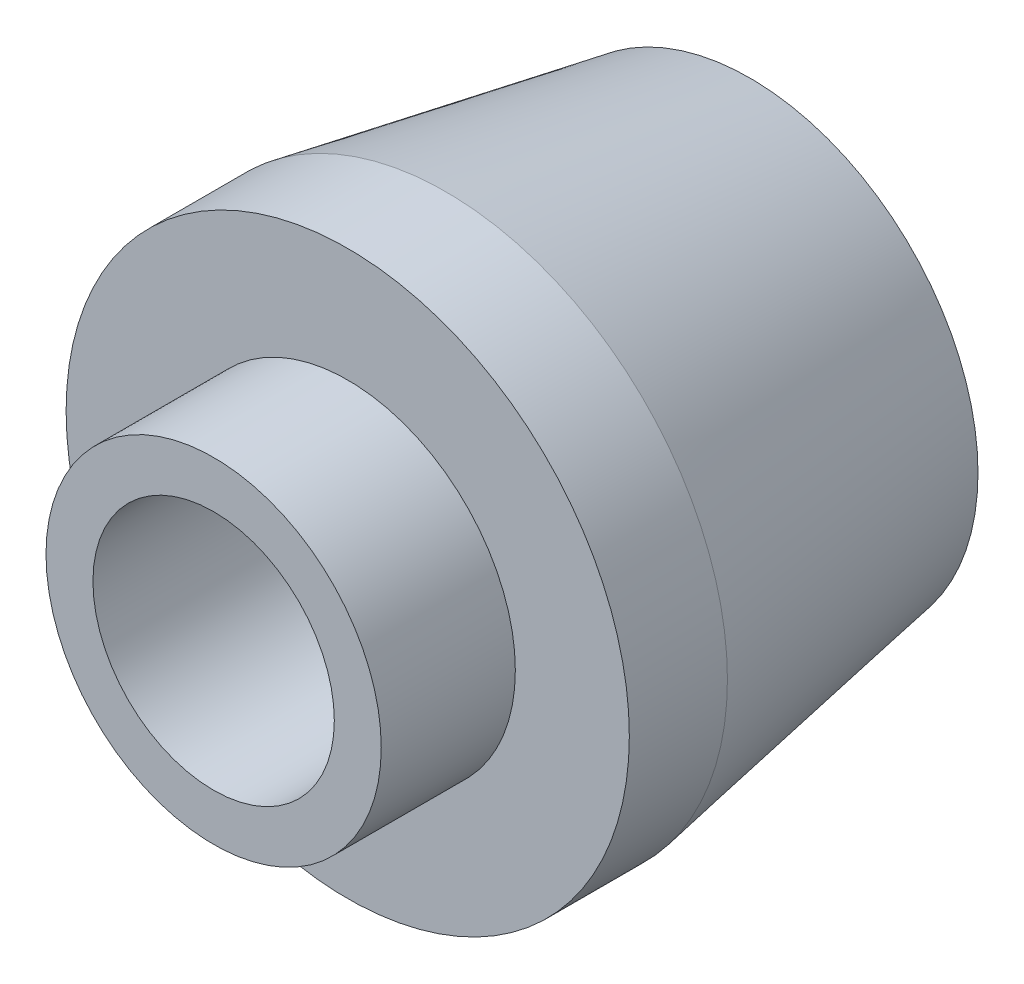
ISO-10303-21;
HEADER;
FILE_DESCRIPTION(('STEP AP214'),'2;1');
FILE_NAME('part.step','',(''),(''),'','','');
FILE_SCHEMA(('AUTOMOTIVE_DESIGN { 1 0 10303 214 1 1 1 1 }'));
ENDSEC;
DATA;
#1=APPLICATION_CONTEXT('core data for automotive mechanical design processes');
#2=APPLICATION_PROTOCOL_DEFINITION('international standard','automotive_design',2000,#1);
#3=PRODUCT_CONTEXT('',#1,'mechanical');
#4=PRODUCT('Part','Part','',(#3));
#5=PRODUCT_RELATED_PRODUCT_CATEGORY('part','',(#4));
#6=PRODUCT_DEFINITION_FORMATION('','',#4);
#7=PRODUCT_DEFINITION_CONTEXT('part definition',#1,'design');
#8=PRODUCT_DEFINITION('design','',#6,#7);
#9=PRODUCT_DEFINITION_SHAPE('','',#8);
#10=(LENGTH_UNIT() NAMED_UNIT(*) SI_UNIT(.MILLI.,.METRE.));
#11=(NAMED_UNIT(*) PLANE_ANGLE_UNIT() SI_UNIT($,.RADIAN.));
#12=(NAMED_UNIT(*) SI_UNIT($,.STERADIAN.) SOLID_ANGLE_UNIT());
#13=UNCERTAINTY_MEASURE_WITH_UNIT(LENGTH_MEASURE(1.E-05),#10,'distance_accuracy_value','');
#14=(GEOMETRIC_REPRESENTATION_CONTEXT(3) GLOBAL_UNCERTAINTY_ASSIGNED_CONTEXT((#13)) GLOBAL_UNIT_ASSIGNED_CONTEXT((#10,
#11,#12)) REPRESENTATION_CONTEXT('',''));
#15=CARTESIAN_POINT('',(0.,0.,0.));
#16=DIRECTION('',(0.,0.,1.));
#17=DIRECTION('',(1.,0.,0.));
#18=AXIS2_PLACEMENT_3D('',#15,#16,#17);
#19=CARTESIAN_POINT('',(0.,0.,15.));
#20=DIRECTION('',(0.,0.,-1.));
#21=DIRECTION('',(-1.,0.,0.));
#22=AXIS2_PLACEMENT_3D('',#19,#20,#21);
#23=CYLINDRICAL_SURFACE('',#22,10.5);
#24=CARTESIAN_POINT('',(0.,0.,11.3425636392353));
#25=DIRECTION('',(0.,0.,1.));
#26=DIRECTION('',(1.,0.,0.));
#27=AXIS2_PLACEMENT_3D('',#24,#25,#26);
#28=CIRCLE('',#27,10.5);
#29=CARTESIAN_POINT('',(10.5,0.,11.3425636392353));
#30=VERTEX_POINT('',#29);
#31=EDGE_CURVE('E40',#30,#30,#28,.T.);
#32=ORIENTED_EDGE('',*,*,#31,.T.);
#33=EDGE_LOOP('',(#32));
#34=FACE_BOUND('',#33,.T.);
#35=CARTESIAN_POINT('',(0.,0.,15.));
#36=DIRECTION('',(0.,0.,1.));
#37=DIRECTION('',(1.,0.,0.));
#38=AXIS2_PLACEMENT_3D('',#35,#36,#37);
#39=CIRCLE('',#38,10.5);
#40=CARTESIAN_POINT('',(10.5,0.,15.));
#41=VERTEX_POINT('',#40);
#42=EDGE_CURVE('E44',#41,#41,#39,.T.);
#43=ORIENTED_EDGE('',*,*,#42,.F.);
#44=EDGE_LOOP('',(#43));
#45=FACE_BOUND('',#44,.T.);
#46=ADVANCED_FACE('F33',(#34,#45),#23,.T.);
#47=CARTESIAN_POINT('',(0.,0.,15.));
#48=DIRECTION('',(0.,0.,1.));
#49=DIRECTION('',(1.,0.,0.));
#50=AXIS2_PLACEMENT_3D('',#47,#48,#49);
#51=PLANE('',#50);
#52=CARTESIAN_POINT('',(0.,0.,15.));
#53=DIRECTION('',(0.,0.,1.));
#54=DIRECTION('',(1.,0.,0.));
#55=AXIS2_PLACEMENT_3D('',#52,#53,#54);
#56=CIRCLE('',#55,6.25);
#57=CARTESIAN_POINT('',(6.25,0.,15.));
#58=VERTEX_POINT('',#57);
#59=EDGE_CURVE('E51',#58,#58,#56,.T.);
#60=ORIENTED_EDGE('',*,*,#59,.F.);
#61=EDGE_LOOP('',(#60));
#62=FACE_BOUND('',#61,.T.);
#63=ORIENTED_EDGE('',*,*,#42,.T.);
#64=EDGE_LOOP('',(#63));
#65=FACE_BOUND('',#64,.T.);
#66=ADVANCED_FACE('F71',(#62,#65),#51,.T.);
#67=CARTESIAN_POINT('',(0.,0.,0.));
#68=DIRECTION('',(0.,0.,1.));
#69=DIRECTION('',(1.,0.,0.));
#70=AXIS2_PLACEMENT_3D('',#67,#68,#69);
#71=PLANE('',#70);
#72=CARTESIAN_POINT('',(0.,0.,0.));
#73=DIRECTION('',(0.,0.,1.));
#74=DIRECTION('',(1.,0.,0.));
#75=AXIS2_PLACEMENT_3D('',#72,#73,#74);
#76=CIRCLE('',#75,8.50000000000001);
#77=CARTESIAN_POINT('',(8.50000000000001,0.,0.));
#78=VERTEX_POINT('',#77);
#79=EDGE_CURVE('E10',#78,#78,#76,.F.);
#80=ORIENTED_EDGE('',*,*,#79,.T.);
#81=EDGE_LOOP('',(#80));
#82=FACE_BOUND('',#81,.T.);
#83=CARTESIAN_POINT('',(0.,0.,0.));
#84=DIRECTION('',(0.,0.,-1.));
#85=DIRECTION('',(-1.,0.,0.));
#86=AXIS2_PLACEMENT_3D('',#83,#84,#85);
#87=CIRCLE('',#86,5.025);
#88=CARTESIAN_POINT('',(-5.025,0.,0.));
#89=VERTEX_POINT('',#88);
#90=EDGE_CURVE('E62',#89,#89,#87,.T.);
#91=ORIENTED_EDGE('',*,*,#90,.F.);
#92=EDGE_LOOP('',(#91));
#93=FACE_BOUND('',#92,.T.);
#94=ADVANCED_FACE('F68',(#82,#93),#71,.F.);
#95=CARTESIAN_POINT('',(0.,0.,20.));
#96=DIRECTION('',(0.,0.,-1.));
#97=DIRECTION('',(-1.,0.,0.));
#98=AXIS2_PLACEMENT_3D('',#95,#96,#97);
#99=CYLINDRICAL_SURFACE('',#98,6.25);
#100=CARTESIAN_POINT('',(0.,0.,20.));
#101=DIRECTION('',(0.,0.,1.));
#102=DIRECTION('',(1.,0.,0.));
#103=AXIS2_PLACEMENT_3D('',#100,#101,#102);
#104=CIRCLE('',#103,6.25);
#105=CARTESIAN_POINT('',(6.25,0.,20.));
#106=VERTEX_POINT('',#105);
#107=EDGE_CURVE('E48',#106,#106,#104,.T.);
#108=ORIENTED_EDGE('',*,*,#107,.F.);
#109=EDGE_LOOP('',(#108));
#110=FACE_BOUND('',#109,.T.);
#111=ORIENTED_EDGE('',*,*,#59,.T.);
#112=EDGE_LOOP('',(#111));
#113=FACE_BOUND('',#112,.T.);
#114=ADVANCED_FACE('F70',(#110,#113),#99,.T.);
#115=CARTESIAN_POINT('',(0.,0.,20.));
#116=DIRECTION('',(0.,0.,1.));
#117=DIRECTION('',(1.,0.,0.));
#118=AXIS2_PLACEMENT_3D('',#115,#116,#117);
#119=PLANE('',#118);
#120=CARTESIAN_POINT('',(0.,0.,20.));
#121=DIRECTION('',(0.,0.,-1.));
#122=DIRECTION('',(-1.,0.,0.));
#123=AXIS2_PLACEMENT_3D('',#120,#121,#122);
#124=CIRCLE('',#123,4.5);
#125=CARTESIAN_POINT('',(-4.5,0.,20.));
#126=VERTEX_POINT('',#125);
#127=EDGE_CURVE('E54',#126,#126,#124,.T.);
#128=ORIENTED_EDGE('',*,*,#127,.T.);
#129=EDGE_LOOP('',(#128));
#130=FACE_BOUND('',#129,.T.);
#131=ORIENTED_EDGE('',*,*,#107,.T.);
#132=EDGE_LOOP('',(#131));
#133=FACE_BOUND('',#132,.T.);
#134=ADVANCED_FACE('F78',(#130,#133),#119,.T.);
#135=CARTESIAN_POINT('',(0.,0.,0.));
#136=DIRECTION('',(0.,0.,-1.));
#137=DIRECTION('',(-1.,0.,0.));
#138=AXIS2_PLACEMENT_3D('',#135,#136,#137);
#139=CYLINDRICAL_SURFACE('',#138,4.5);
#140=ORIENTED_EDGE('',*,*,#127,.F.);
#141=EDGE_LOOP('',(#140));
#142=FACE_BOUND('',#141,.T.);
#143=CARTESIAN_POINT('',(0.,0.,0.524999999999999));
#144=DIRECTION('',(0.,0.,-1.));
#145=DIRECTION('',(-1.,0.,0.));
#146=AXIS2_PLACEMENT_3D('',#143,#144,#145);
#147=CIRCLE('',#146,4.5);
#148=CARTESIAN_POINT('',(-4.5,0.,0.524999999999999));
#149=VERTEX_POINT('',#148);
#150=EDGE_CURVE('E59',#149,#149,#147,.T.);
#151=ORIENTED_EDGE('',*,*,#150,.T.);
#152=EDGE_LOOP('',(#151));
#153=FACE_BOUND('',#152,.T.);
#154=ADVANCED_FACE('F96',(#142,#153),#139,.F.);
#155=CARTESIAN_POINT('',(0.,0.,0.));
#156=DIRECTION('',(0.,0.,-1.));
#157=DIRECTION('',(-1.,0.,0.));
#158=AXIS2_PLACEMENT_3D('',#155,#156,#157);
#159=CONICAL_SURFACE('',#158,5.025,0.785398163397451);
#160=ORIENTED_EDGE('',*,*,#150,.F.);
#161=EDGE_LOOP('',(#160));
#162=FACE_BOUND('',#161,.T.);
#163=ORIENTED_EDGE('',*,*,#90,.T.);
#164=EDGE_LOOP('',(#163));
#165=FACE_BOUND('',#164,.T.);
#166=ADVANCED_FACE('F66',(#162,#165),#159,.F.);
#167=CARTESIAN_POINT('',(0.,0.,11.3425636392353));
#168=DIRECTION('',(0.,0.,1.));
#169=DIRECTION('',(1.,0.,0.));
#170=AXIS2_PLACEMENT_3D('',#167,#168,#169);
#171=CONICAL_SURFACE('',#170,10.5,0.174532925199434);
#172=ORIENTED_EDGE('',*,*,#79,.F.);
#173=EDGE_LOOP('',(#172));
#174=FACE_BOUND('',#173,.T.);
#175=ORIENTED_EDGE('',*,*,#31,.F.);
#176=EDGE_LOOP('',(#175));
#177=FACE_BOUND('',#176,.T.);
#178=ADVANCED_FACE('F35',(#174,#177),#171,.T.);
#179=CLOSED_SHELL('',(#46,#66,#94,#114,#134,#154,#166,#178));
#180=MANIFOLD_SOLID_BREP('B2',#179);
#181=ADVANCED_BREP_SHAPE_REPRESENTATION('',(#18,#180),#14);
#182=SHAPE_DEFINITION_REPRESENTATION(#9,#181);
ENDSEC;
END-ISO-10303-21;
